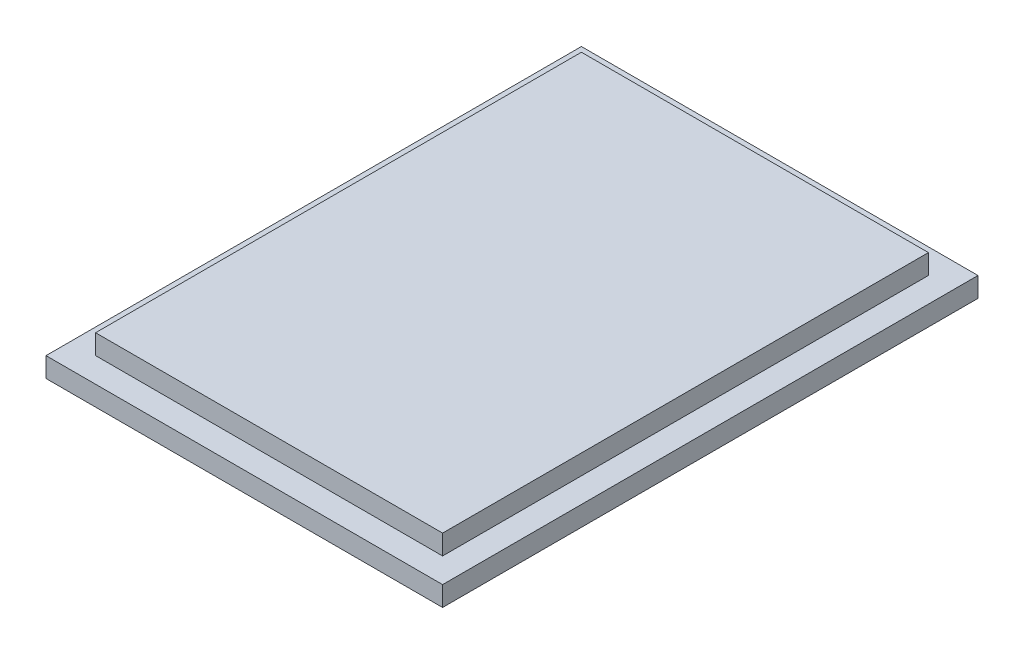
ISO-10303-21;
HEADER;
FILE_DESCRIPTION(('STEP AP214'),'2;1');
FILE_NAME('part.step','',(''),(''),'','','');
FILE_SCHEMA(('AUTOMOTIVE_DESIGN { 1 0 10303 214 1 1 1 1 }'));
ENDSEC;
DATA;
#1=APPLICATION_CONTEXT('core data for automotive mechanical design processes');
#2=APPLICATION_PROTOCOL_DEFINITION('international standard','automotive_design',2000,#1);
#3=PRODUCT_CONTEXT('',#1,'mechanical');
#4=PRODUCT('Part','Part','',(#3));
#5=PRODUCT_RELATED_PRODUCT_CATEGORY('part','',(#4));
#6=PRODUCT_DEFINITION_FORMATION('','',#4);
#7=PRODUCT_DEFINITION_CONTEXT('part definition',#1,'design');
#8=PRODUCT_DEFINITION('design','',#6,#7);
#9=PRODUCT_DEFINITION_SHAPE('','',#8);
#10=(LENGTH_UNIT() NAMED_UNIT(*) SI_UNIT(.MILLI.,.METRE.));
#11=(NAMED_UNIT(*) PLANE_ANGLE_UNIT() SI_UNIT($,.RADIAN.));
#12=(NAMED_UNIT(*) SI_UNIT($,.STERADIAN.) SOLID_ANGLE_UNIT());
#13=UNCERTAINTY_MEASURE_WITH_UNIT(LENGTH_MEASURE(1.E-05),#10,'distance_accuracy_value','');
#14=(GEOMETRIC_REPRESENTATION_CONTEXT(3) GLOBAL_UNCERTAINTY_ASSIGNED_CONTEXT((#13)) GLOBAL_UNIT_ASSIGNED_CONTEXT((#10,
#11,#12)) REPRESENTATION_CONTEXT('',''));
#15=CARTESIAN_POINT('',(0.,0.,0.));
#16=DIRECTION('',(0.,0.,1.));
#17=DIRECTION('',(1.,0.,0.));
#18=AXIS2_PLACEMENT_3D('',#15,#16,#17);
#19=CARTESIAN_POINT('',(0.,1.,0.));
#20=DIRECTION('',(0.,-1.,0.));
#21=DIRECTION('',(0.,0.,-1.));
#22=AXIS2_PLACEMENT_3D('',#19,#20,#21);
#23=PLANE('',#22);
#24=DIRECTION('',(0.,0.,1.));
#25=VECTOR('',#24,1.);
#26=CARTESIAN_POINT('',(0.,1.,0.));
#27=LINE('',#26,#25);
#28=CARTESIAN_POINT('',(0.,1.,-27.));
#29=VERTEX_POINT('',#28);
#30=CARTESIAN_POINT('',(0.,1.,0.));
#31=VERTEX_POINT('',#30);
#32=EDGE_CURVE('E173',#29,#31,#27,.T.);
#33=ORIENTED_EDGE('',*,*,#32,.T.);
#34=DIRECTION('',(1.,0.,0.));
#35=VECTOR('',#34,1.);
#36=CARTESIAN_POINT('',(0.,1.,0.));
#37=LINE('',#36,#35);
#38=CARTESIAN_POINT('',(20.,1.,0.));
#39=VERTEX_POINT('',#38);
#40=EDGE_CURVE('E90',#31,#39,#37,.T.);
#41=ORIENTED_EDGE('',*,*,#40,.T.);
#42=DIRECTION('',(0.,0.,-1.));
#43=VECTOR('',#42,1.);
#44=CARTESIAN_POINT('',(20.,1.,0.));
#45=LINE('',#44,#43);
#46=CARTESIAN_POINT('',(20.,1.,-27.));
#47=VERTEX_POINT('',#46);
#48=EDGE_CURVE('E178',#39,#47,#45,.T.);
#49=ORIENTED_EDGE('',*,*,#48,.T.);
#50=DIRECTION('',(-1.,0.,0.));
#51=VECTOR('',#50,1.);
#52=CARTESIAN_POINT('',(0.,1.,-27.));
#53=LINE('',#52,#51);
#54=EDGE_CURVE('E59',#47,#29,#53,.T.);
#55=ORIENTED_EDGE('',*,*,#54,.T.);
#56=EDGE_LOOP('',(#33,#41,#49,#55));
#57=FACE_BOUND('',#56,.T.);
#58=DIRECTION('',(1.,0.,0.));
#59=VECTOR('',#58,1.);
#60=CARTESIAN_POINT('',(1.25,1.,-1.25));
#61=LINE('',#60,#59);
#62=CARTESIAN_POINT('',(1.25,1.,-1.25));
#63=VERTEX_POINT('',#62);
#64=CARTESIAN_POINT('',(18.75,1.,-1.25));
#65=VERTEX_POINT('',#64);
#66=EDGE_CURVE('E129',#63,#65,#61,.T.);
#67=ORIENTED_EDGE('',*,*,#66,.F.);
#68=DIRECTION('',(0.,0.,1.));
#69=VECTOR('',#68,1.);
#70=CARTESIAN_POINT('',(1.25,1.,-1.25));
#71=LINE('',#70,#69);
#72=CARTESIAN_POINT('',(1.25,1.,-25.75));
#73=VERTEX_POINT('',#72);
#74=EDGE_CURVE('E125',#73,#63,#71,.T.);
#75=ORIENTED_EDGE('',*,*,#74,.F.);
#76=DIRECTION('',(-1.,0.,0.));
#77=VECTOR('',#76,1.);
#78=CARTESIAN_POINT('',(1.25,1.,-25.75));
#79=LINE('',#78,#77);
#80=CARTESIAN_POINT('',(18.75,1.,-25.75));
#81=VERTEX_POINT('',#80);
#82=EDGE_CURVE('E166',#81,#73,#79,.T.);
#83=ORIENTED_EDGE('',*,*,#82,.F.);
#84=DIRECTION('',(0.,0.,-1.));
#85=VECTOR('',#84,1.);
#86=CARTESIAN_POINT('',(18.75,1.,-1.25));
#87=LINE('',#86,#85);
#88=EDGE_CURVE('E162',#65,#81,#87,.T.);
#89=ORIENTED_EDGE('',*,*,#88,.F.);
#90=EDGE_LOOP('',(#67,#75,#83,#89));
#91=FACE_BOUND('',#90,.T.);
#92=ADVANCED_FACE('F41',(#57,#91),#23,.F.);
#93=CARTESIAN_POINT('',(0.,0.,0.));
#94=DIRECTION('',(0.,-1.,0.));
#95=DIRECTION('',(0.,0.,-1.));
#96=AXIS2_PLACEMENT_3D('',#93,#94,#95);
#97=PLANE('',#96);
#98=DIRECTION('',(0.,0.,1.));
#99=VECTOR('',#98,1.);
#100=CARTESIAN_POINT('',(0.,0.,0.));
#101=LINE('',#100,#99);
#102=CARTESIAN_POINT('',(0.,0.,-27.));
#103=VERTEX_POINT('',#102);
#104=CARTESIAN_POINT('',(0.,0.,0.));
#105=VERTEX_POINT('',#104);
#106=EDGE_CURVE('E172',#103,#105,#101,.T.);
#107=ORIENTED_EDGE('',*,*,#106,.F.);
#108=DIRECTION('',(-1.,0.,0.));
#109=VECTOR('',#108,1.);
#110=CARTESIAN_POINT('',(0.,0.,-27.));
#111=LINE('',#110,#109);
#112=CARTESIAN_POINT('',(20.,0.,-27.));
#113=VERTEX_POINT('',#112);
#114=EDGE_CURVE('E83',#113,#103,#111,.T.);
#115=ORIENTED_EDGE('',*,*,#114,.F.);
#116=DIRECTION('',(0.,0.,-1.));
#117=VECTOR('',#116,1.);
#118=CARTESIAN_POINT('',(20.,0.,0.));
#119=LINE('',#118,#117);
#120=CARTESIAN_POINT('',(20.,0.,0.));
#121=VERTEX_POINT('',#120);
#122=EDGE_CURVE('E77',#121,#113,#119,.T.);
#123=ORIENTED_EDGE('',*,*,#122,.F.);
#124=DIRECTION('',(1.,0.,0.));
#125=VECTOR('',#124,1.);
#126=CARTESIAN_POINT('',(0.,0.,0.));
#127=LINE('',#126,#125);
#128=EDGE_CURVE('E187',#105,#121,#127,.T.);
#129=ORIENTED_EDGE('',*,*,#128,.F.);
#130=EDGE_LOOP('',(#107,#115,#123,#129));
#131=FACE_BOUND('',#130,.T.);
#132=ADVANCED_FACE('F203',(#131),#97,.T.);
#133=CARTESIAN_POINT('',(0.,1.,0.));
#134=DIRECTION('',(1.,0.,0.));
#135=DIRECTION('',(0.,0.,-1.));
#136=AXIS2_PLACEMENT_3D('',#133,#134,#135);
#137=PLANE('',#136);
#138=ORIENTED_EDGE('',*,*,#106,.T.);
#139=DIRECTION('',(0.,-1.,0.));
#140=VECTOR('',#139,1.);
#141=CARTESIAN_POINT('',(0.,1.,0.));
#142=LINE('',#141,#140);
#143=EDGE_CURVE('E11',#31,#105,#142,.T.);
#144=ORIENTED_EDGE('',*,*,#143,.F.);
#145=ORIENTED_EDGE('',*,*,#32,.F.);
#146=DIRECTION('',(0.,-1.,0.));
#147=VECTOR('',#146,1.);
#148=CARTESIAN_POINT('',(0.,1.,-27.));
#149=LINE('',#148,#147);
#150=EDGE_CURVE('E183',#29,#103,#149,.T.);
#151=ORIENTED_EDGE('',*,*,#150,.T.);
#152=EDGE_LOOP('',(#138,#144,#145,#151));
#153=FACE_BOUND('',#152,.T.);
#154=ADVANCED_FACE('F43',(#153),#137,.F.);
#155=CARTESIAN_POINT('',(0.,1.,0.));
#156=DIRECTION('',(0.,0.,-1.));
#157=DIRECTION('',(-1.,0.,0.));
#158=AXIS2_PLACEMENT_3D('',#155,#156,#157);
#159=PLANE('',#158);
#160=ORIENTED_EDGE('',*,*,#128,.T.);
#161=DIRECTION('',(0.,-1.,0.));
#162=VECTOR('',#161,1.);
#163=CARTESIAN_POINT('',(20.,1.,0.));
#164=LINE('',#163,#162);
#165=EDGE_CURVE('E51',#39,#121,#164,.T.);
#166=ORIENTED_EDGE('',*,*,#165,.F.);
#167=ORIENTED_EDGE('',*,*,#40,.F.);
#168=ORIENTED_EDGE('',*,*,#143,.T.);
#169=EDGE_LOOP('',(#160,#166,#167,#168));
#170=FACE_BOUND('',#169,.T.);
#171=ADVANCED_FACE('F216',(#170),#159,.F.);
#172=CARTESIAN_POINT('',(20.,1.,0.));
#173=DIRECTION('',(-1.,0.,0.));
#174=DIRECTION('',(0.,0.,1.));
#175=AXIS2_PLACEMENT_3D('',#172,#173,#174);
#176=PLANE('',#175);
#177=ORIENTED_EDGE('',*,*,#122,.T.);
#178=DIRECTION('',(0.,-1.,0.));
#179=VECTOR('',#178,1.);
#180=CARTESIAN_POINT('',(20.,1.,-27.));
#181=LINE('',#180,#179);
#182=EDGE_CURVE('E196',#47,#113,#181,.T.);
#183=ORIENTED_EDGE('',*,*,#182,.F.);
#184=ORIENTED_EDGE('',*,*,#48,.F.);
#185=ORIENTED_EDGE('',*,*,#165,.T.);
#186=EDGE_LOOP('',(#177,#183,#184,#185));
#187=FACE_BOUND('',#186,.T.);
#188=ADVANCED_FACE('F200',(#187),#176,.F.);
#189=CARTESIAN_POINT('',(0.,1.,-27.));
#190=DIRECTION('',(0.,0.,1.));
#191=DIRECTION('',(1.,0.,0.));
#192=AXIS2_PLACEMENT_3D('',#189,#190,#191);
#193=PLANE('',#192);
#194=ORIENTED_EDGE('',*,*,#114,.T.);
#195=ORIENTED_EDGE('',*,*,#150,.F.);
#196=ORIENTED_EDGE('',*,*,#54,.F.);
#197=ORIENTED_EDGE('',*,*,#182,.T.);
#198=EDGE_LOOP('',(#194,#195,#196,#197));
#199=FACE_BOUND('',#198,.T.);
#200=ADVANCED_FACE('F207',(#199),#193,.F.);
#201=CARTESIAN_POINT('',(1.25,2.,0.));
#202=DIRECTION('',(-1.,0.,0.));
#203=DIRECTION('',(0.,0.,1.));
#204=AXIS2_PLACEMENT_3D('',#201,#202,#203);
#205=PLANE('',#204);
#206=ORIENTED_EDGE('',*,*,#74,.T.);
#207=DIRECTION('',(0.,-1.,0.));
#208=VECTOR('',#207,1.);
#209=CARTESIAN_POINT('',(1.25,2.,-1.25));
#210=LINE('',#209,#208);
#211=CARTESIAN_POINT('',(1.25,2.,-1.25));
#212=VERTEX_POINT('',#211);
#213=EDGE_CURVE('E118',#212,#63,#210,.T.);
#214=ORIENTED_EDGE('',*,*,#213,.F.);
#215=DIRECTION('',(0.,0.,-1.));
#216=VECTOR('',#215,1.);
#217=CARTESIAN_POINT('',(1.25,2.,0.));
#218=LINE('',#217,#216);
#219=CARTESIAN_POINT('',(1.25,2.,-25.75));
#220=VERTEX_POINT('',#219);
#221=EDGE_CURVE('E123',#212,#220,#218,.T.);
#222=ORIENTED_EDGE('',*,*,#221,.T.);
#223=DIRECTION('',(0.,-1.,0.));
#224=VECTOR('',#223,1.);
#225=CARTESIAN_POINT('',(1.25,2.,-25.75));
#226=LINE('',#225,#224);
#227=EDGE_CURVE('E151',#220,#73,#226,.T.);
#228=ORIENTED_EDGE('',*,*,#227,.T.);
#229=EDGE_LOOP('',(#206,#214,#222,#228));
#230=FACE_BOUND('',#229,.T.);
#231=ADVANCED_FACE('F120',(#230),#205,.T.);
#232=CARTESIAN_POINT('',(18.75,2.,0.));
#233=DIRECTION('',(-1.,0.,0.));
#234=DIRECTION('',(0.,0.,1.));
#235=AXIS2_PLACEMENT_3D('',#232,#233,#234);
#236=PLANE('',#235);
#237=DIRECTION('',(0.,-1.,0.));
#238=VECTOR('',#237,1.);
#239=CARTESIAN_POINT('',(18.75,2.,-1.25));
#240=LINE('',#239,#238);
#241=CARTESIAN_POINT('',(18.75,2.,-1.25));
#242=VERTEX_POINT('',#241);
#243=EDGE_CURVE('E130',#242,#65,#240,.T.);
#244=ORIENTED_EDGE('',*,*,#243,.T.);
#245=ORIENTED_EDGE('',*,*,#88,.T.);
#246=DIRECTION('',(0.,-1.,0.));
#247=VECTOR('',#246,1.);
#248=CARTESIAN_POINT('',(18.75,2.,-25.75));
#249=LINE('',#248,#247);
#250=CARTESIAN_POINT('',(18.75,2.,-25.75));
#251=VERTEX_POINT('',#250);
#252=EDGE_CURVE('E154',#251,#81,#249,.T.);
#253=ORIENTED_EDGE('',*,*,#252,.F.);
#254=DIRECTION('',(0.,0.,-1.));
#255=VECTOR('',#254,1.);
#256=CARTESIAN_POINT('',(18.75,2.,0.));
#257=LINE('',#256,#255);
#258=EDGE_CURVE('E139',#242,#251,#257,.T.);
#259=ORIENTED_EDGE('',*,*,#258,.F.);
#260=EDGE_LOOP('',(#244,#245,#253,#259));
#261=FACE_BOUND('',#260,.T.);
#262=ADVANCED_FACE('F214',(#261),#236,.F.);
#263=CARTESIAN_POINT('',(0.,2.,-1.25));
#264=DIRECTION('',(0.,0.,-1.));
#265=DIRECTION('',(-1.,0.,0.));
#266=AXIS2_PLACEMENT_3D('',#263,#264,#265);
#267=PLANE('',#266);
#268=ORIENTED_EDGE('',*,*,#213,.T.);
#269=ORIENTED_EDGE('',*,*,#66,.T.);
#270=ORIENTED_EDGE('',*,*,#243,.F.);
#271=DIRECTION('',(1.,0.,0.));
#272=VECTOR('',#271,1.);
#273=CARTESIAN_POINT('',(0.,2.,-1.25));
#274=LINE('',#273,#272);
#275=EDGE_CURVE('E133',#212,#242,#274,.T.);
#276=ORIENTED_EDGE('',*,*,#275,.F.);
#277=EDGE_LOOP('',(#268,#269,#270,#276));
#278=FACE_BOUND('',#277,.T.);
#279=ADVANCED_FACE('F134',(#278),#267,.F.);
#280=CARTESIAN_POINT('',(0.,2.,-25.75));
#281=DIRECTION('',(0.,0.,-1.));
#282=DIRECTION('',(-1.,0.,0.));
#283=AXIS2_PLACEMENT_3D('',#280,#281,#282);
#284=PLANE('',#283);
#285=ORIENTED_EDGE('',*,*,#82,.T.);
#286=ORIENTED_EDGE('',*,*,#227,.F.);
#287=DIRECTION('',(1.,0.,0.));
#288=VECTOR('',#287,1.);
#289=CARTESIAN_POINT('',(0.,2.,-25.75));
#290=LINE('',#289,#288);
#291=EDGE_CURVE('E143',#220,#251,#290,.T.);
#292=ORIENTED_EDGE('',*,*,#291,.T.);
#293=ORIENTED_EDGE('',*,*,#252,.T.);
#294=EDGE_LOOP('',(#285,#286,#292,#293));
#295=FACE_BOUND('',#294,.T.);
#296=ADVANCED_FACE('F228',(#295),#284,.T.);
#297=CARTESIAN_POINT('',(0.,2.,0.));
#298=DIRECTION('',(0.,1.,0.));
#299=DIRECTION('',(0.,0.,1.));
#300=AXIS2_PLACEMENT_3D('',#297,#298,#299);
#301=PLANE('',#300);
#302=ORIENTED_EDGE('',*,*,#221,.F.);
#303=ORIENTED_EDGE('',*,*,#275,.T.);
#304=ORIENTED_EDGE('',*,*,#258,.T.);
#305=ORIENTED_EDGE('',*,*,#291,.F.);
#306=EDGE_LOOP('',(#302,#303,#304,#305));
#307=FACE_BOUND('',#306,.T.);
#308=ADVANCED_FACE('F141',(#307),#301,.T.);
#309=CLOSED_SHELL('',(#92,#132,#154,#171,#188,#200,#231,#262,#279,#296,#308));
#310=MANIFOLD_SOLID_BREP('B2',#309);
#311=ADVANCED_BREP_SHAPE_REPRESENTATION('',(#18,#310),#14);
#312=SHAPE_DEFINITION_REPRESENTATION(#9,#311);
ENDSEC;
END-ISO-10303-21;
